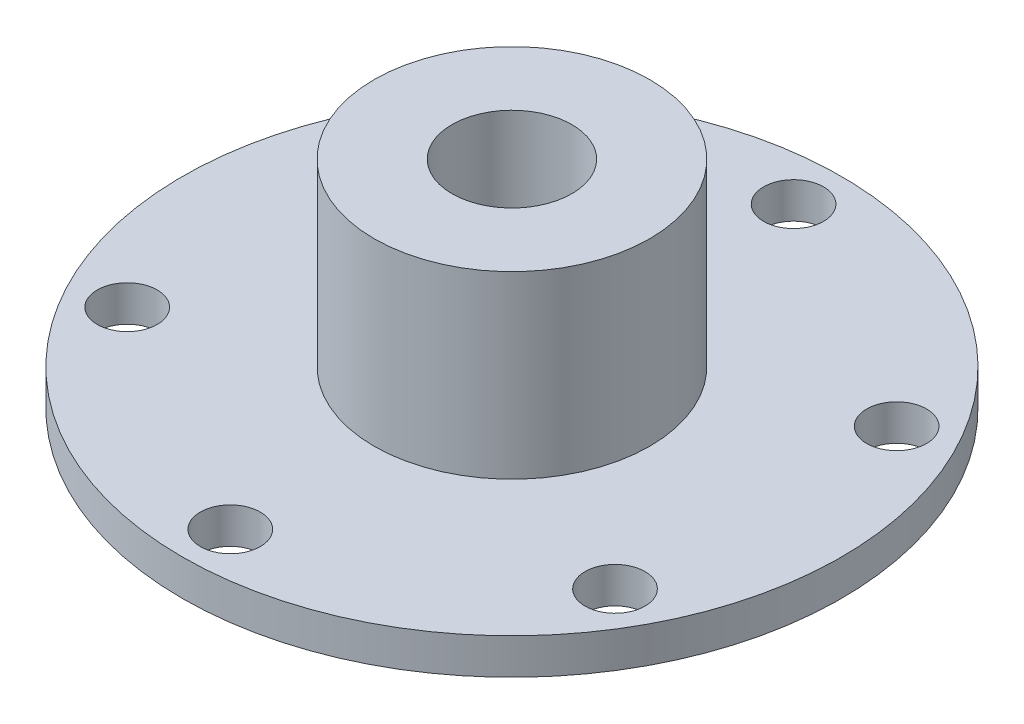
ISO-10303-21;
HEADER;
FILE_DESCRIPTION(('STEP AP214'),'2;1');
FILE_NAME('part.step','',(''),(''),'','','');
FILE_SCHEMA(('AUTOMOTIVE_DESIGN { 1 0 10303 214 1 1 1 1 }'));
ENDSEC;
DATA;
#1=APPLICATION_CONTEXT('core data for automotive mechanical design processes');
#2=APPLICATION_PROTOCOL_DEFINITION('international standard','automotive_design',2000,#1);
#3=PRODUCT_CONTEXT('',#1,'mechanical');
#4=PRODUCT('Part','Part','',(#3));
#5=PRODUCT_RELATED_PRODUCT_CATEGORY('part','',(#4));
#6=PRODUCT_DEFINITION_FORMATION('','',#4);
#7=PRODUCT_DEFINITION_CONTEXT('part definition',#1,'design');
#8=PRODUCT_DEFINITION('design','',#6,#7);
#9=PRODUCT_DEFINITION_SHAPE('','',#8);
#10=(LENGTH_UNIT() NAMED_UNIT(*) SI_UNIT(.MILLI.,.METRE.));
#11=(NAMED_UNIT(*) PLANE_ANGLE_UNIT() SI_UNIT($,.RADIAN.));
#12=(NAMED_UNIT(*) SI_UNIT($,.STERADIAN.) SOLID_ANGLE_UNIT());
#13=UNCERTAINTY_MEASURE_WITH_UNIT(LENGTH_MEASURE(1.E-05),#10,'distance_accuracy_value','');
#14=(GEOMETRIC_REPRESENTATION_CONTEXT(3) GLOBAL_UNCERTAINTY_ASSIGNED_CONTEXT((#13)) GLOBAL_UNIT_ASSIGNED_CONTEXT((#10,
#11,#12)) REPRESENTATION_CONTEXT('',''));
#15=CARTESIAN_POINT('',(0.,0.,0.));
#16=DIRECTION('',(0.,0.,1.));
#17=DIRECTION('',(1.,0.,0.));
#18=AXIS2_PLACEMENT_3D('',#15,#16,#17);
#19=CARTESIAN_POINT('',(0.,3.,0.));
#20=DIRECTION('',(0.,1.,0.));
#21=DIRECTION('',(0.,0.,1.));
#22=AXIS2_PLACEMENT_3D('',#19,#20,#21);
#23=PLANE('',#22);
#24=CARTESIAN_POINT('',(-20.3515969889342,3.,-11.7500000000002));
#25=DIRECTION('',(0.,1.,0.));
#26=DIRECTION('',(0.,0.,1.));
#27=AXIS2_PLACEMENT_3D('',#24,#25,#26);
#28=CIRCLE('',#27,2.5);
#29=CARTESIAN_POINT('',(-20.3515969889342,3.,-9.25000000000023));
#30=VERTEX_POINT('',#29);
#31=EDGE_CURVE('E96',#30,#30,#28,.T.);
#32=ORIENTED_EDGE('',*,*,#31,.F.);
#33=EDGE_LOOP('',(#32));
#34=FACE_BOUND('',#33,.T.);
#35=CARTESIAN_POINT('',(-1.62069135962672E-13,3.,23.5));
#36=DIRECTION('',(0.,1.,0.));
#37=DIRECTION('',(0.,0.,1.));
#38=AXIS2_PLACEMENT_3D('',#35,#36,#37);
#39=CIRCLE('',#38,2.5);
#40=CARTESIAN_POINT('',(-1.62069135962672E-13,3.,26.));
#41=VERTEX_POINT('',#40);
#42=EDGE_CURVE('E80',#41,#41,#39,.T.);
#43=ORIENTED_EDGE('',*,*,#42,.F.);
#44=EDGE_LOOP('',(#43));
#45=FACE_BOUND('',#44,.T.);
#46=CARTESIAN_POINT('',(20.3515969889345,3.,-11.7499999999997));
#47=DIRECTION('',(0.,1.,0.));
#48=DIRECTION('',(0.,0.,1.));
#49=AXIS2_PLACEMENT_3D('',#46,#47,#48);
#50=CIRCLE('',#49,2.5);
#51=CARTESIAN_POINT('',(20.3515969889345,3.,-9.24999999999967));
#52=VERTEX_POINT('',#51);
#53=EDGE_CURVE('E64',#52,#52,#50,.T.);
#54=ORIENTED_EDGE('',*,*,#53,.F.);
#55=EDGE_LOOP('',(#54));
#56=FACE_BOUND('',#55,.T.);
#57=CARTESIAN_POINT('',(0.,3.,0.));
#58=DIRECTION('',(0.,1.,0.));
#59=DIRECTION('',(0.,0.,1.));
#60=AXIS2_PLACEMENT_3D('',#57,#58,#59);
#61=CIRCLE('',#60,27.5);
#62=CARTESIAN_POINT('',(0.,3.,27.5));
#63=VERTEX_POINT('',#62);
#64=EDGE_CURVE('E10',#63,#63,#61,.T.);
#65=ORIENTED_EDGE('',*,*,#64,.T.);
#66=EDGE_LOOP('',(#65));
#67=FACE_BOUND('',#66,.T.);
#68=CARTESIAN_POINT('',(0.,3.,-23.5));
#69=DIRECTION('',(0.,1.,0.));
#70=DIRECTION('',(0.,0.,1.));
#71=AXIS2_PLACEMENT_3D('',#68,#69,#70);
#72=CIRCLE('',#71,2.5);
#73=CARTESIAN_POINT('',(0.,3.,-21.));
#74=VERTEX_POINT('',#73);
#75=EDGE_CURVE('E59',#74,#74,#72,.T.);
#76=ORIENTED_EDGE('',*,*,#75,.F.);
#77=EDGE_LOOP('',(#76));
#78=FACE_BOUND('',#77,.T.);
#79=CARTESIAN_POINT('',(20.3515969889341,3.,11.7500000000004));
#80=DIRECTION('',(0.,1.,0.));
#81=DIRECTION('',(0.,0.,1.));
#82=AXIS2_PLACEMENT_3D('',#79,#80,#81);
#83=CIRCLE('',#82,2.5);
#84=CARTESIAN_POINT('',(20.3515969889341,3.,14.2500000000004));
#85=VERTEX_POINT('',#84);
#86=EDGE_CURVE('E72',#85,#85,#83,.T.);
#87=ORIENTED_EDGE('',*,*,#86,.F.);
#88=EDGE_LOOP('',(#87));
#89=FACE_BOUND('',#88,.T.);
#90=CARTESIAN_POINT('',(-20.3515969889344,3.,11.7499999999998));
#91=DIRECTION('',(0.,1.,0.));
#92=DIRECTION('',(0.,0.,1.));
#93=AXIS2_PLACEMENT_3D('',#90,#91,#92);
#94=CIRCLE('',#93,2.5);
#95=CARTESIAN_POINT('',(-20.3515969889344,3.,14.2499999999998));
#96=VERTEX_POINT('',#95);
#97=EDGE_CURVE('E88',#96,#96,#94,.T.);
#98=ORIENTED_EDGE('',*,*,#97,.F.);
#99=EDGE_LOOP('',(#98));
#100=FACE_BOUND('',#99,.T.);
#101=CARTESIAN_POINT('',(0.,3.,0.));
#102=DIRECTION('',(0.,1.,0.));
#103=DIRECTION('',(0.,0.,1.));
#104=AXIS2_PLACEMENT_3D('',#101,#102,#103);
#105=CIRCLE('',#104,11.5);
#106=CARTESIAN_POINT('',(0.,3.,11.5));
#107=VERTEX_POINT('',#106);
#108=EDGE_CURVE('E108',#107,#107,#105,.T.);
#109=ORIENTED_EDGE('',*,*,#108,.F.);
#110=EDGE_LOOP('',(#109));
#111=FACE_BOUND('',#110,.T.);
#112=ADVANCED_FACE('F41',(#34,#45,#56,#67,#78,#89,#100,#111),#23,.T.);
#113=CARTESIAN_POINT('',(0.,0.,0.));
#114=DIRECTION('',(0.,1.,0.));
#115=DIRECTION('',(0.,0.,1.));
#116=AXIS2_PLACEMENT_3D('',#113,#114,#115);
#117=PLANE('',#116);
#118=CARTESIAN_POINT('',(0.,0.,0.));
#119=DIRECTION('',(0.,1.,0.));
#120=DIRECTION('',(0.,0.,1.));
#121=AXIS2_PLACEMENT_3D('',#118,#119,#120);
#122=CIRCLE('',#121,27.5);
#123=CARTESIAN_POINT('',(0.,0.,27.5));
#124=VERTEX_POINT('',#123);
#125=EDGE_CURVE('E45',#124,#124,#122,.T.);
#126=ORIENTED_EDGE('',*,*,#125,.F.);
#127=EDGE_LOOP('',(#126));
#128=FACE_BOUND('',#127,.T.);
#129=CARTESIAN_POINT('',(0.,0.,0.));
#130=DIRECTION('',(0.,1.,0.));
#131=DIRECTION('',(0.,0.,1.));
#132=AXIS2_PLACEMENT_3D('',#129,#130,#131);
#133=CIRCLE('',#132,5.);
#134=CARTESIAN_POINT('',(0.,0.,5.));
#135=VERTEX_POINT('',#134);
#136=EDGE_CURVE('E54',#135,#135,#133,.T.);
#137=ORIENTED_EDGE('',*,*,#136,.T.);
#138=EDGE_LOOP('',(#137));
#139=FACE_BOUND('',#138,.T.);
#140=CARTESIAN_POINT('',(0.,0.,-23.5));
#141=DIRECTION('',(0.,1.,0.));
#142=DIRECTION('',(0.,0.,1.));
#143=AXIS2_PLACEMENT_3D('',#140,#141,#142);
#144=CIRCLE('',#143,2.5);
#145=CARTESIAN_POINT('',(0.,0.,-21.));
#146=VERTEX_POINT('',#145);
#147=EDGE_CURVE('E60',#146,#146,#144,.T.);
#148=ORIENTED_EDGE('',*,*,#147,.T.);
#149=EDGE_LOOP('',(#148));
#150=FACE_BOUND('',#149,.T.);
#151=CARTESIAN_POINT('',(20.3515969889345,0.,-11.7499999999997));
#152=DIRECTION('',(0.,1.,0.));
#153=DIRECTION('',(0.,0.,1.));
#154=AXIS2_PLACEMENT_3D('',#151,#152,#153);
#155=CIRCLE('',#154,2.5);
#156=CARTESIAN_POINT('',(20.3515969889345,0.,-9.24999999999967));
#157=VERTEX_POINT('',#156);
#158=EDGE_CURVE('E68',#157,#157,#155,.T.);
#159=ORIENTED_EDGE('',*,*,#158,.T.);
#160=EDGE_LOOP('',(#159));
#161=FACE_BOUND('',#160,.T.);
#162=CARTESIAN_POINT('',(20.3515969889341,0.,11.7500000000004));
#163=DIRECTION('',(0.,1.,0.));
#164=DIRECTION('',(0.,0.,1.));
#165=AXIS2_PLACEMENT_3D('',#162,#163,#164);
#166=CIRCLE('',#165,2.5);
#167=CARTESIAN_POINT('',(20.3515969889341,0.,14.2500000000004));
#168=VERTEX_POINT('',#167);
#169=EDGE_CURVE('E76',#168,#168,#166,.T.);
#170=ORIENTED_EDGE('',*,*,#169,.T.);
#171=EDGE_LOOP('',(#170));
#172=FACE_BOUND('',#171,.T.);
#173=CARTESIAN_POINT('',(-1.62069135962672E-13,0.,23.5));
#174=DIRECTION('',(0.,1.,0.));
#175=DIRECTION('',(0.,0.,1.));
#176=AXIS2_PLACEMENT_3D('',#173,#174,#175);
#177=CIRCLE('',#176,2.5);
#178=CARTESIAN_POINT('',(-1.62069135962672E-13,0.,26.));
#179=VERTEX_POINT('',#178);
#180=EDGE_CURVE('E84',#179,#179,#177,.T.);
#181=ORIENTED_EDGE('',*,*,#180,.T.);
#182=EDGE_LOOP('',(#181));
#183=FACE_BOUND('',#182,.T.);
#184=CARTESIAN_POINT('',(-20.3515969889344,0.,11.7499999999998));
#185=DIRECTION('',(0.,1.,0.));
#186=DIRECTION('',(0.,0.,1.));
#187=AXIS2_PLACEMENT_3D('',#184,#185,#186);
#188=CIRCLE('',#187,2.5);
#189=CARTESIAN_POINT('',(-20.3515969889344,0.,14.2499999999998));
#190=VERTEX_POINT('',#189);
#191=EDGE_CURVE('E92',#190,#190,#188,.T.);
#192=ORIENTED_EDGE('',*,*,#191,.T.);
#193=EDGE_LOOP('',(#192));
#194=FACE_BOUND('',#193,.T.);
#195=CARTESIAN_POINT('',(-20.3515969889342,0.,-11.7500000000002));
#196=DIRECTION('',(0.,1.,0.));
#197=DIRECTION('',(0.,0.,1.));
#198=AXIS2_PLACEMENT_3D('',#195,#196,#197);
#199=CIRCLE('',#198,2.5);
#200=CARTESIAN_POINT('',(-20.3515969889342,0.,-9.25000000000023));
#201=VERTEX_POINT('',#200);
#202=EDGE_CURVE('E100',#201,#201,#199,.T.);
#203=ORIENTED_EDGE('',*,*,#202,.T.);
#204=EDGE_LOOP('',(#203));
#205=FACE_BOUND('',#204,.T.);
#206=ADVANCED_FACE('F138',(#128,#139,#150,#161,#172,#183,#194,#205),#117,.F.);
#207=CARTESIAN_POINT('',(0.,3.,0.));
#208=DIRECTION('',(0.,-1.,0.));
#209=DIRECTION('',(0.,0.,-1.));
#210=AXIS2_PLACEMENT_3D('',#207,#208,#209);
#211=CYLINDRICAL_SURFACE('',#210,27.5);
#212=ORIENTED_EDGE('',*,*,#64,.F.);
#213=EDGE_LOOP('',(#212));
#214=FACE_BOUND('',#213,.T.);
#215=ORIENTED_EDGE('',*,*,#125,.T.);
#216=EDGE_LOOP('',(#215));
#217=FACE_BOUND('',#216,.T.);
#218=ADVANCED_FACE('F43',(#214,#217),#211,.T.);
#219=CARTESIAN_POINT('',(0.,3.,0.));
#220=DIRECTION('',(0.,-1.,0.));
#221=DIRECTION('',(0.,0.,-1.));
#222=AXIS2_PLACEMENT_3D('',#219,#220,#221);
#223=CYLINDRICAL_SURFACE('',#222,5.);
#224=ORIENTED_EDGE('',*,*,#136,.F.);
#225=EDGE_LOOP('',(#224));
#226=FACE_BOUND('',#225,.T.);
#227=CARTESIAN_POINT('',(0.,18.,0.));
#228=DIRECTION('',(0.,1.,0.));
#229=DIRECTION('',(0.,0.,1.));
#230=AXIS2_PLACEMENT_3D('',#227,#228,#229);
#231=CIRCLE('',#230,5.);
#232=CARTESIAN_POINT('',(0.,18.,5.));
#233=VERTEX_POINT('',#232);
#234=EDGE_CURVE('E112',#233,#233,#231,.T.);
#235=ORIENTED_EDGE('',*,*,#234,.T.);
#236=EDGE_LOOP('',(#235));
#237=FACE_BOUND('',#236,.T.);
#238=ADVANCED_FACE('F120',(#226,#237),#223,.F.);
#239=CARTESIAN_POINT('',(0.,3.,-23.5));
#240=DIRECTION('',(0.,-1.,0.));
#241=DIRECTION('',(0.,0.,-1.));
#242=AXIS2_PLACEMENT_3D('',#239,#240,#241);
#243=CYLINDRICAL_SURFACE('',#242,2.5);
#244=ORIENTED_EDGE('',*,*,#75,.T.);
#245=EDGE_LOOP('',(#244));
#246=FACE_BOUND('',#245,.T.);
#247=ORIENTED_EDGE('',*,*,#147,.F.);
#248=EDGE_LOOP('',(#247));
#249=FACE_BOUND('',#248,.T.);
#250=ADVANCED_FACE('F150',(#246,#249),#243,.F.);
#251=CARTESIAN_POINT('',(20.3515969889345,3.,-11.7499999999997));
#252=DIRECTION('',(0.,-1.,0.));
#253=DIRECTION('',(0.,0.,-1.));
#254=AXIS2_PLACEMENT_3D('',#251,#252,#253);
#255=CYLINDRICAL_SURFACE('',#254,2.5);
#256=ORIENTED_EDGE('',*,*,#53,.T.);
#257=EDGE_LOOP('',(#256));
#258=FACE_BOUND('',#257,.T.);
#259=ORIENTED_EDGE('',*,*,#158,.F.);
#260=EDGE_LOOP('',(#259));
#261=FACE_BOUND('',#260,.T.);
#262=ADVANCED_FACE('F154',(#258,#261),#255,.F.);
#263=CARTESIAN_POINT('',(20.3515969889341,3.,11.7500000000004));
#264=DIRECTION('',(0.,-1.,0.));
#265=DIRECTION('',(0.,0.,-1.));
#266=AXIS2_PLACEMENT_3D('',#263,#264,#265);
#267=CYLINDRICAL_SURFACE('',#266,2.5);
#268=ORIENTED_EDGE('',*,*,#86,.T.);
#269=EDGE_LOOP('',(#268));
#270=FACE_BOUND('',#269,.T.);
#271=ORIENTED_EDGE('',*,*,#169,.F.);
#272=EDGE_LOOP('',(#271));
#273=FACE_BOUND('',#272,.T.);
#274=ADVANCED_FACE('F158',(#270,#273),#267,.F.);
#275=CARTESIAN_POINT('',(-1.62069135962672E-13,3.,23.5));
#276=DIRECTION('',(0.,-1.,0.));
#277=DIRECTION('',(0.,0.,-1.));
#278=AXIS2_PLACEMENT_3D('',#275,#276,#277);
#279=CYLINDRICAL_SURFACE('',#278,2.5);
#280=ORIENTED_EDGE('',*,*,#42,.T.);
#281=EDGE_LOOP('',(#280));
#282=FACE_BOUND('',#281,.T.);
#283=ORIENTED_EDGE('',*,*,#180,.F.);
#284=EDGE_LOOP('',(#283));
#285=FACE_BOUND('',#284,.T.);
#286=ADVANCED_FACE('F162',(#282,#285),#279,.F.);
#287=CARTESIAN_POINT('',(-20.3515969889344,3.,11.7499999999998));
#288=DIRECTION('',(0.,-1.,0.));
#289=DIRECTION('',(0.,0.,-1.));
#290=AXIS2_PLACEMENT_3D('',#287,#288,#289);
#291=CYLINDRICAL_SURFACE('',#290,2.5);
#292=ORIENTED_EDGE('',*,*,#97,.T.);
#293=EDGE_LOOP('',(#292));
#294=FACE_BOUND('',#293,.T.);
#295=ORIENTED_EDGE('',*,*,#191,.F.);
#296=EDGE_LOOP('',(#295));
#297=FACE_BOUND('',#296,.T.);
#298=ADVANCED_FACE('F134',(#294,#297),#291,.F.);
#299=CARTESIAN_POINT('',(-20.3515969889342,3.,-11.7500000000002));
#300=DIRECTION('',(0.,-1.,0.));
#301=DIRECTION('',(0.,0.,-1.));
#302=AXIS2_PLACEMENT_3D('',#299,#300,#301);
#303=CYLINDRICAL_SURFACE('',#302,2.5);
#304=ORIENTED_EDGE('',*,*,#31,.T.);
#305=EDGE_LOOP('',(#304));
#306=FACE_BOUND('',#305,.T.);
#307=ORIENTED_EDGE('',*,*,#202,.F.);
#308=EDGE_LOOP('',(#307));
#309=FACE_BOUND('',#308,.T.);
#310=ADVANCED_FACE('F125',(#306,#309),#303,.F.);
#311=CARTESIAN_POINT('',(0.,18.,0.));
#312=DIRECTION('',(0.,1.,0.));
#313=DIRECTION('',(0.,0.,1.));
#314=AXIS2_PLACEMENT_3D('',#311,#312,#313);
#315=PLANE('',#314);
#316=CARTESIAN_POINT('',(0.,18.,0.));
#317=DIRECTION('',(0.,1.,0.));
#318=DIRECTION('',(0.,0.,1.));
#319=AXIS2_PLACEMENT_3D('',#316,#317,#318);
#320=CIRCLE('',#319,11.5);
#321=CARTESIAN_POINT('',(0.,18.,11.5));
#322=VERTEX_POINT('',#321);
#323=EDGE_CURVE('E104',#322,#322,#320,.T.);
#324=ORIENTED_EDGE('',*,*,#323,.T.);
#325=EDGE_LOOP('',(#324));
#326=FACE_BOUND('',#325,.T.);
#327=ORIENTED_EDGE('',*,*,#234,.F.);
#328=EDGE_LOOP('',(#327));
#329=FACE_BOUND('',#328,.T.);
#330=ADVANCED_FACE('F122',(#326,#329),#315,.T.);
#331=CARTESIAN_POINT('',(0.,18.,0.));
#332=DIRECTION('',(0.,-1.,0.));
#333=DIRECTION('',(0.,0.,-1.));
#334=AXIS2_PLACEMENT_3D('',#331,#332,#333);
#335=CYLINDRICAL_SURFACE('',#334,11.5);
#336=ORIENTED_EDGE('',*,*,#323,.F.);
#337=EDGE_LOOP('',(#336));
#338=FACE_BOUND('',#337,.T.);
#339=ORIENTED_EDGE('',*,*,#108,.T.);
#340=EDGE_LOOP('',(#339));
#341=FACE_BOUND('',#340,.T.);
#342=ADVANCED_FACE('F124',(#338,#341),#335,.T.);
#343=CLOSED_SHELL('',(#112,#206,#218,#238,#250,#262,#274,#286,#298,#310,#330,#342));
#344=MANIFOLD_SOLID_BREP('B2',#343);
#345=ADVANCED_BREP_SHAPE_REPRESENTATION('',(#18,#344),#14);
#346=SHAPE_DEFINITION_REPRESENTATION(#9,#345);
ENDSEC;
END-ISO-10303-21;
